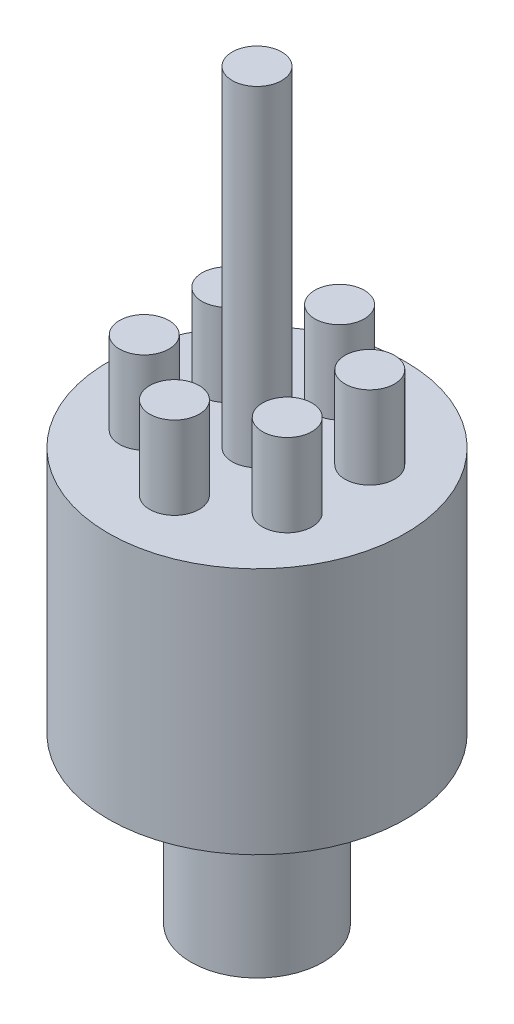
ISO-10303-21;
HEADER;
FILE_DESCRIPTION(('STEP AP214'),'2;1');
FILE_NAME('part.step','',(''),(''),'','','');
FILE_SCHEMA(('AUTOMOTIVE_DESIGN { 1 0 10303 214 1 1 1 1 }'));
ENDSEC;
DATA;
#1=APPLICATION_CONTEXT('core data for automotive mechanical design processes');
#2=APPLICATION_PROTOCOL_DEFINITION('international standard','automotive_design',2000,#1);
#3=PRODUCT_CONTEXT('',#1,'mechanical');
#4=PRODUCT('Part','Part','',(#3));
#5=PRODUCT_RELATED_PRODUCT_CATEGORY('part','',(#4));
#6=PRODUCT_DEFINITION_FORMATION('','',#4);
#7=PRODUCT_DEFINITION_CONTEXT('part definition',#1,'design');
#8=PRODUCT_DEFINITION('design','',#6,#7);
#9=PRODUCT_DEFINITION_SHAPE('','',#8);
#10=(LENGTH_UNIT() NAMED_UNIT(*) SI_UNIT(.MILLI.,.METRE.));
#11=(NAMED_UNIT(*) PLANE_ANGLE_UNIT() SI_UNIT($,.RADIAN.));
#12=(NAMED_UNIT(*) SI_UNIT($,.STERADIAN.) SOLID_ANGLE_UNIT());
#13=UNCERTAINTY_MEASURE_WITH_UNIT(LENGTH_MEASURE(1.E-05),#10,'distance_accuracy_value','');
#14=(GEOMETRIC_REPRESENTATION_CONTEXT(3) GLOBAL_UNCERTAINTY_ASSIGNED_CONTEXT((#13)) GLOBAL_UNIT_ASSIGNED_CONTEXT((#10,
#11,#12)) REPRESENTATION_CONTEXT('',''));
#15=CARTESIAN_POINT('',(0.,0.,0.));
#16=DIRECTION('',(0.,0.,1.));
#17=DIRECTION('',(1.,0.,0.));
#18=AXIS2_PLACEMENT_3D('',#15,#16,#17);
#19=CARTESIAN_POINT('',(0.,0.,0.));
#20=DIRECTION('',(0.,-1.,0.));
#21=DIRECTION('',(0.,0.,-1.));
#22=AXIS2_PLACEMENT_3D('',#19,#20,#21);
#23=PLANE('',#22);
#24=CARTESIAN_POINT('',(0.,0.,0.));
#25=DIRECTION('',(0.,1.,0.));
#26=DIRECTION('',(0.,0.,1.));
#27=AXIS2_PLACEMENT_3D('',#24,#25,#26);
#28=CIRCLE('',#27,7.99999999999999);
#29=CARTESIAN_POINT('',(0.,0.,7.99999999999999));
#30=VERTEX_POINT('',#29);
#31=EDGE_CURVE('E10',#30,#30,#28,.T.);
#32=ORIENTED_EDGE('',*,*,#31,.F.);
#33=EDGE_LOOP('',(#32));
#34=FACE_BOUND('',#33,.T.);
#35=ADVANCED_FACE('F37',(#34),#23,.T.);
#36=CARTESIAN_POINT('',(0.,90.,0.));
#37=DIRECTION('',(0.,1.,0.));
#38=DIRECTION('',(0.,0.,1.));
#39=AXIS2_PLACEMENT_3D('',#36,#37,#38);
#40=CYLINDRICAL_SURFACE('',#39,7.99999999999999);
#41=ORIENTED_EDGE('',*,*,#31,.T.);
#42=EDGE_LOOP('',(#41));
#43=FACE_BOUND('',#42,.T.);
#44=CARTESIAN_POINT('',(0.,20.,0.));
#45=DIRECTION('',(0.,1.,0.));
#46=DIRECTION('',(0.,0.,1.));
#47=AXIS2_PLACEMENT_3D('',#44,#45,#46);
#48=CIRCLE('',#47,7.99999999999999);
#49=CARTESIAN_POINT('',(0.,20.,7.99999999999999));
#50=VERTEX_POINT('',#49);
#51=EDGE_CURVE('E44',#50,#50,#48,.T.);
#52=ORIENTED_EDGE('',*,*,#51,.F.);
#53=EDGE_LOOP('',(#52));
#54=FACE_BOUND('',#53,.T.);
#55=ADVANCED_FACE('F162',(#43,#54),#40,.T.);
#56=CARTESIAN_POINT('',(0.,20.,7.99999999999999));
#57=DIRECTION('',(0.,-1.,0.));
#58=DIRECTION('',(0.,0.,-1.));
#59=AXIS2_PLACEMENT_3D('',#56,#57,#58);
#60=PLANE('',#59);
#61=ORIENTED_EDGE('',*,*,#51,.T.);
#62=EDGE_LOOP('',(#61));
#63=FACE_BOUND('',#62,.T.);
#64=CARTESIAN_POINT('',(0.,20.,0.));
#65=DIRECTION('',(0.,1.,0.));
#66=DIRECTION('',(0.,0.,1.));
#67=AXIS2_PLACEMENT_3D('',#64,#65,#66);
#68=CIRCLE('',#67,18.);
#69=CARTESIAN_POINT('',(0.,20.,18.));
#70=VERTEX_POINT('',#69);
#71=EDGE_CURVE('E49',#70,#70,#68,.T.);
#72=ORIENTED_EDGE('',*,*,#71,.F.);
#73=EDGE_LOOP('',(#72));
#74=FACE_BOUND('',#73,.T.);
#75=ADVANCED_FACE('F167',(#63,#74),#60,.T.);
#76=CARTESIAN_POINT('',(0.,90.,0.));
#77=DIRECTION('',(0.,1.,0.));
#78=DIRECTION('',(0.,0.,1.));
#79=AXIS2_PLACEMENT_3D('',#76,#77,#78);
#80=CYLINDRICAL_SURFACE('',#79,18.);
#81=ORIENTED_EDGE('',*,*,#71,.T.);
#82=EDGE_LOOP('',(#81));
#83=FACE_BOUND('',#82,.T.);
#84=CARTESIAN_POINT('',(0.,50.,0.));
#85=DIRECTION('',(0.,1.,0.));
#86=DIRECTION('',(0.,0.,1.));
#87=AXIS2_PLACEMENT_3D('',#84,#85,#86);
#88=CIRCLE('',#87,18.);
#89=CARTESIAN_POINT('',(0.,50.,18.));
#90=VERTEX_POINT('',#89);
#91=EDGE_CURVE('E54',#90,#90,#88,.T.);
#92=ORIENTED_EDGE('',*,*,#91,.F.);
#93=EDGE_LOOP('',(#92));
#94=FACE_BOUND('',#93,.T.);
#95=ADVANCED_FACE('F130',(#83,#94),#80,.T.);
#96=CARTESIAN_POINT('',(0.,50.,18.));
#97=DIRECTION('',(0.,1.,0.));
#98=DIRECTION('',(0.,0.,1.));
#99=AXIS2_PLACEMENT_3D('',#96,#97,#98);
#100=PLANE('',#99);
#101=CARTESIAN_POINT('',(8.66025403784433,50.,-5.0000000000001));
#102=DIRECTION('',(0.,1.,0.));
#103=DIRECTION('',(-0.866025403784433,0.,0.50000000000001));
#104=AXIS2_PLACEMENT_3D('',#101,#102,#103);
#105=CIRCLE('',#104,3.);
#106=CARTESIAN_POINT('',(6.06217782649103,50.,-3.50000000000007));
#107=VERTEX_POINT('',#106);
#108=EDGE_CURVE('E109',#107,#107,#105,.T.);
#109=ORIENTED_EDGE('',*,*,#108,.F.);
#110=EDGE_LOOP('',(#109));
#111=FACE_BOUND('',#110,.T.);
#112=CARTESIAN_POINT('',(8.66025403784443,50.,4.99999999999992));
#113=DIRECTION('',(0.,1.,0.));
#114=DIRECTION('',(-0.866025403784443,0.,-0.499999999999992));
#115=AXIS2_PLACEMENT_3D('',#112,#113,#114);
#116=CIRCLE('',#115,3.);
#117=CARTESIAN_POINT('',(6.0621778264911,50.,3.49999999999994));
#118=VERTEX_POINT('',#117);
#119=EDGE_CURVE('E101',#118,#118,#116,.T.);
#120=ORIENTED_EDGE('',*,*,#119,.F.);
#121=EDGE_LOOP('',(#120));
#122=FACE_BOUND('',#121,.T.);
#123=CARTESIAN_POINT('',(0.,50.,10.));
#124=DIRECTION('',(0.,1.,0.));
#125=DIRECTION('',(0.,0.,-1.));
#126=AXIS2_PLACEMENT_3D('',#123,#124,#125);
#127=CIRCLE('',#126,3.);
#128=CARTESIAN_POINT('',(0.,50.,7.));
#129=VERTEX_POINT('',#128);
#130=EDGE_CURVE('E93',#129,#129,#127,.T.);
#131=ORIENTED_EDGE('',*,*,#130,.F.);
#132=EDGE_LOOP('',(#131));
#133=FACE_BOUND('',#132,.T.);
#134=CARTESIAN_POINT('',(-8.66025403784437,50.,5.00000000000004));
#135=DIRECTION('',(0.,1.,0.));
#136=DIRECTION('',(0.866025403784436,0.,-0.500000000000004));
#137=AXIS2_PLACEMENT_3D('',#134,#135,#136);
#138=CIRCLE('',#137,3.);
#139=CARTESIAN_POINT('',(-6.06217782649106,50.,3.50000000000003));
#140=VERTEX_POINT('',#139);
#141=EDGE_CURVE('E85',#140,#140,#138,.T.);
#142=ORIENTED_EDGE('',*,*,#141,.F.);
#143=EDGE_LOOP('',(#142));
#144=FACE_BOUND('',#143,.T.);
#145=CARTESIAN_POINT('',(-8.6602540378444,50.,-4.99999999999998));
#146=DIRECTION('',(0.,1.,0.));
#147=DIRECTION('',(0.86602540378444,0.,0.499999999999998));
#148=AXIS2_PLACEMENT_3D('',#145,#146,#147);
#149=CIRCLE('',#148,3.);
#150=CARTESIAN_POINT('',(-6.06217782649108,50.,-3.49999999999999));
#151=VERTEX_POINT('',#150);
#152=EDGE_CURVE('E77',#151,#151,#149,.T.);
#153=ORIENTED_EDGE('',*,*,#152,.F.);
#154=EDGE_LOOP('',(#153));
#155=FACE_BOUND('',#154,.T.);
#156=CARTESIAN_POINT('',(0.,50.,-10.));
#157=DIRECTION('',(0.,1.,0.));
#158=DIRECTION('',(0.,0.,1.));
#159=AXIS2_PLACEMENT_3D('',#156,#157,#158);
#160=CIRCLE('',#159,3.);
#161=CARTESIAN_POINT('',(0.,50.,-7.));
#162=VERTEX_POINT('',#161);
#163=EDGE_CURVE('E69',#162,#162,#160,.T.);
#164=ORIENTED_EDGE('',*,*,#163,.F.);
#165=EDGE_LOOP('',(#164));
#166=FACE_BOUND('',#165,.T.);
#167=ORIENTED_EDGE('',*,*,#91,.T.);
#168=EDGE_LOOP('',(#167));
#169=FACE_BOUND('',#168,.T.);
#170=CARTESIAN_POINT('',(0.,50.,0.));
#171=DIRECTION('',(0.,1.,0.));
#172=DIRECTION('',(0.,0.,1.));
#173=AXIS2_PLACEMENT_3D('',#170,#171,#172);
#174=CIRCLE('',#173,3.);
#175=CARTESIAN_POINT('',(0.,50.,3.));
#176=VERTEX_POINT('',#175);
#177=EDGE_CURVE('E60',#176,#176,#174,.T.);
#178=ORIENTED_EDGE('',*,*,#177,.F.);
#179=EDGE_LOOP('',(#178));
#180=FACE_BOUND('',#179,.T.);
#181=ADVANCED_FACE('F126',(#111,#122,#133,#144,#155,#166,#169,#180),#100,.T.);
#182=CARTESIAN_POINT('',(0.,90.,0.));
#183=DIRECTION('',(0.,1.,0.));
#184=DIRECTION('',(0.,0.,1.));
#185=AXIS2_PLACEMENT_3D('',#182,#183,#184);
#186=CYLINDRICAL_SURFACE('',#185,3.);
#187=ORIENTED_EDGE('',*,*,#177,.T.);
#188=EDGE_LOOP('',(#187));
#189=FACE_BOUND('',#188,.T.);
#190=CARTESIAN_POINT('',(0.,90.,0.));
#191=DIRECTION('',(0.,1.,0.));
#192=DIRECTION('',(0.,0.,1.));
#193=AXIS2_PLACEMENT_3D('',#190,#191,#192);
#194=CIRCLE('',#193,3.);
#195=CARTESIAN_POINT('',(0.,90.,3.));
#196=VERTEX_POINT('',#195);
#197=EDGE_CURVE('E64',#196,#196,#194,.T.);
#198=ORIENTED_EDGE('',*,*,#197,.F.);
#199=EDGE_LOOP('',(#198));
#200=FACE_BOUND('',#199,.T.);
#201=ADVANCED_FACE('F129',(#189,#200),#186,.T.);
#202=CARTESIAN_POINT('',(0.,90.,3.));
#203=DIRECTION('',(0.,1.,0.));
#204=DIRECTION('',(0.,0.,1.));
#205=AXIS2_PLACEMENT_3D('',#202,#203,#204);
#206=PLANE('',#205);
#207=ORIENTED_EDGE('',*,*,#197,.T.);
#208=EDGE_LOOP('',(#207));
#209=FACE_BOUND('',#208,.T.);
#210=ADVANCED_FACE('F148',(#209),#206,.T.);
#211=CARTESIAN_POINT('',(0.,60.,-10.));
#212=DIRECTION('',(0.,-1.,0.));
#213=DIRECTION('',(0.,0.,-1.));
#214=AXIS2_PLACEMENT_3D('',#211,#212,#213);
#215=CYLINDRICAL_SURFACE('',#214,3.);
#216=CARTESIAN_POINT('',(0.,60.,-10.));
#217=DIRECTION('',(0.,1.,0.));
#218=DIRECTION('',(0.,0.,1.));
#219=AXIS2_PLACEMENT_3D('',#216,#217,#218);
#220=CIRCLE('',#219,3.);
#221=CARTESIAN_POINT('',(0.,60.,-7.));
#222=VERTEX_POINT('',#221);
#223=EDGE_CURVE('E68',#222,#222,#220,.T.);
#224=ORIENTED_EDGE('',*,*,#223,.F.);
#225=EDGE_LOOP('',(#224));
#226=FACE_BOUND('',#225,.T.);
#227=ORIENTED_EDGE('',*,*,#163,.T.);
#228=EDGE_LOOP('',(#227));
#229=FACE_BOUND('',#228,.T.);
#230=ADVANCED_FACE('F153',(#226,#229),#215,.T.);
#231=CARTESIAN_POINT('',(0.,60.,-10.));
#232=DIRECTION('',(0.,1.,0.));
#233=DIRECTION('',(0.,0.,1.));
#234=AXIS2_PLACEMENT_3D('',#231,#232,#233);
#235=PLANE('',#234);
#236=ORIENTED_EDGE('',*,*,#223,.T.);
#237=EDGE_LOOP('',(#236));
#238=FACE_BOUND('',#237,.T.);
#239=ADVANCED_FACE('F158',(#238),#235,.T.);
#240=CARTESIAN_POINT('',(-8.6602540378444,60.,-4.99999999999998));
#241=DIRECTION('',(0.,-1.,0.));
#242=DIRECTION('',(0.,0.,-1.));
#243=AXIS2_PLACEMENT_3D('',#240,#241,#242);
#244=CYLINDRICAL_SURFACE('',#243,3.);
#245=CARTESIAN_POINT('',(-8.6602540378444,60.,-4.99999999999998));
#246=DIRECTION('',(0.,1.,0.));
#247=DIRECTION('',(0.86602540378444,0.,0.499999999999998));
#248=AXIS2_PLACEMENT_3D('',#245,#246,#247);
#249=CIRCLE('',#248,3.);
#250=CARTESIAN_POINT('',(-6.06217782649108,60.,-3.49999999999999));
#251=VERTEX_POINT('',#250);
#252=EDGE_CURVE('E73',#251,#251,#249,.T.);
#253=ORIENTED_EDGE('',*,*,#252,.F.);
#254=EDGE_LOOP('',(#253));
#255=FACE_BOUND('',#254,.T.);
#256=ORIENTED_EDGE('',*,*,#152,.T.);
#257=EDGE_LOOP('',(#256));
#258=FACE_BOUND('',#257,.T.);
#259=ADVANCED_FACE('F210',(#255,#258),#244,.T.);
#260=CARTESIAN_POINT('',(-8.6602540378444,60.,-4.99999999999998));
#261=DIRECTION('',(0.,1.,0.));
#262=DIRECTION('',(0.86602540378444,0.,0.499999999999998));
#263=AXIS2_PLACEMENT_3D('',#260,#261,#262);
#264=PLANE('',#263);
#265=ORIENTED_EDGE('',*,*,#252,.T.);
#266=EDGE_LOOP('',(#265));
#267=FACE_BOUND('',#266,.T.);
#268=ADVANCED_FACE('F220',(#267),#264,.T.);
#269=CARTESIAN_POINT('',(-8.66025403784437,60.,5.00000000000004));
#270=DIRECTION('',(0.,-1.,0.));
#271=DIRECTION('',(0.,0.,-1.));
#272=AXIS2_PLACEMENT_3D('',#269,#270,#271);
#273=CYLINDRICAL_SURFACE('',#272,3.);
#274=CARTESIAN_POINT('',(-8.66025403784437,60.,5.00000000000004));
#275=DIRECTION('',(0.,1.,0.));
#276=DIRECTION('',(0.866025403784436,0.,-0.500000000000004));
#277=AXIS2_PLACEMENT_3D('',#274,#275,#276);
#278=CIRCLE('',#277,3.);
#279=CARTESIAN_POINT('',(-6.06217782649106,60.,3.50000000000003));
#280=VERTEX_POINT('',#279);
#281=EDGE_CURVE('E81',#280,#280,#278,.T.);
#282=ORIENTED_EDGE('',*,*,#281,.F.);
#283=EDGE_LOOP('',(#282));
#284=FACE_BOUND('',#283,.T.);
#285=ORIENTED_EDGE('',*,*,#141,.T.);
#286=EDGE_LOOP('',(#285));
#287=FACE_BOUND('',#286,.T.);
#288=ADVANCED_FACE('F227',(#284,#287),#273,.T.);
#289=CARTESIAN_POINT('',(-8.66025403784437,60.,5.00000000000004));
#290=DIRECTION('',(0.,1.,0.));
#291=DIRECTION('',(0.866025403784436,0.,-0.500000000000004));
#292=AXIS2_PLACEMENT_3D('',#289,#290,#291);
#293=PLANE('',#292);
#294=ORIENTED_EDGE('',*,*,#281,.T.);
#295=EDGE_LOOP('',(#294));
#296=FACE_BOUND('',#295,.T.);
#297=ADVANCED_FACE('F235',(#296),#293,.T.);
#298=CARTESIAN_POINT('',(0.,60.,10.));
#299=DIRECTION('',(0.,-1.,0.));
#300=DIRECTION('',(0.,0.,-1.));
#301=AXIS2_PLACEMENT_3D('',#298,#299,#300);
#302=CYLINDRICAL_SURFACE('',#301,3.);
#303=CARTESIAN_POINT('',(0.,60.,10.));
#304=DIRECTION('',(0.,1.,0.));
#305=DIRECTION('',(0.,0.,-1.));
#306=AXIS2_PLACEMENT_3D('',#303,#304,#305);
#307=CIRCLE('',#306,3.);
#308=CARTESIAN_POINT('',(0.,60.,7.));
#309=VERTEX_POINT('',#308);
#310=EDGE_CURVE('E89',#309,#309,#307,.T.);
#311=ORIENTED_EDGE('',*,*,#310,.F.);
#312=EDGE_LOOP('',(#311));
#313=FACE_BOUND('',#312,.T.);
#314=ORIENTED_EDGE('',*,*,#130,.T.);
#315=EDGE_LOOP('',(#314));
#316=FACE_BOUND('',#315,.T.);
#317=ADVANCED_FACE('F243',(#313,#316),#302,.T.);
#318=CARTESIAN_POINT('',(0.,60.,10.));
#319=DIRECTION('',(0.,1.,0.));
#320=DIRECTION('',(0.,0.,-1.));
#321=AXIS2_PLACEMENT_3D('',#318,#319,#320);
#322=PLANE('',#321);
#323=ORIENTED_EDGE('',*,*,#310,.T.);
#324=EDGE_LOOP('',(#323));
#325=FACE_BOUND('',#324,.T.);
#326=ADVANCED_FACE('F251',(#325),#322,.T.);
#327=CARTESIAN_POINT('',(8.66025403784443,60.,4.99999999999992));
#328=DIRECTION('',(0.,-1.,0.));
#329=DIRECTION('',(0.,0.,-1.));
#330=AXIS2_PLACEMENT_3D('',#327,#328,#329);
#331=CYLINDRICAL_SURFACE('',#330,3.);
#332=CARTESIAN_POINT('',(8.66025403784443,60.,4.99999999999992));
#333=DIRECTION('',(0.,1.,0.));
#334=DIRECTION('',(-0.866025403784443,0.,-0.499999999999992));
#335=AXIS2_PLACEMENT_3D('',#332,#333,#334);
#336=CIRCLE('',#335,3.);
#337=CARTESIAN_POINT('',(6.0621778264911,60.,3.49999999999994));
#338=VERTEX_POINT('',#337);
#339=EDGE_CURVE('E97',#338,#338,#336,.T.);
#340=ORIENTED_EDGE('',*,*,#339,.F.);
#341=EDGE_LOOP('',(#340));
#342=FACE_BOUND('',#341,.T.);
#343=ORIENTED_EDGE('',*,*,#119,.T.);
#344=EDGE_LOOP('',(#343));
#345=FACE_BOUND('',#344,.T.);
#346=ADVANCED_FACE('F259',(#342,#345),#331,.T.);
#347=CARTESIAN_POINT('',(8.66025403784443,60.,4.99999999999992));
#348=DIRECTION('',(0.,1.,0.));
#349=DIRECTION('',(-0.866025403784443,0.,-0.499999999999992));
#350=AXIS2_PLACEMENT_3D('',#347,#348,#349);
#351=PLANE('',#350);
#352=ORIENTED_EDGE('',*,*,#339,.T.);
#353=EDGE_LOOP('',(#352));
#354=FACE_BOUND('',#353,.T.);
#355=ADVANCED_FACE('F122',(#354),#351,.T.);
#356=CARTESIAN_POINT('',(8.66025403784433,60.,-5.0000000000001));
#357=DIRECTION('',(0.,-1.,0.));
#358=DIRECTION('',(0.,0.,-1.));
#359=AXIS2_PLACEMENT_3D('',#356,#357,#358);
#360=CYLINDRICAL_SURFACE('',#359,3.);
#361=CARTESIAN_POINT('',(8.66025403784433,60.,-5.0000000000001));
#362=DIRECTION('',(0.,1.,0.));
#363=DIRECTION('',(-0.866025403784433,0.,0.50000000000001));
#364=AXIS2_PLACEMENT_3D('',#361,#362,#363);
#365=CIRCLE('',#364,3.);
#366=CARTESIAN_POINT('',(6.06217782649103,60.,-3.50000000000007));
#367=VERTEX_POINT('',#366);
#368=EDGE_CURVE('E105',#367,#367,#365,.T.);
#369=ORIENTED_EDGE('',*,*,#368,.F.);
#370=EDGE_LOOP('',(#369));
#371=FACE_BOUND('',#370,.T.);
#372=ORIENTED_EDGE('',*,*,#108,.T.);
#373=EDGE_LOOP('',(#372));
#374=FACE_BOUND('',#373,.T.);
#375=ADVANCED_FACE('F119',(#371,#374),#360,.T.);
#376=CARTESIAN_POINT('',(8.66025403784433,60.,-5.0000000000001));
#377=DIRECTION('',(0.,1.,0.));
#378=DIRECTION('',(-0.866025403784433,0.,0.50000000000001));
#379=AXIS2_PLACEMENT_3D('',#376,#377,#378);
#380=PLANE('',#379);
#381=ORIENTED_EDGE('',*,*,#368,.T.);
#382=EDGE_LOOP('',(#381));
#383=FACE_BOUND('',#382,.T.);
#384=ADVANCED_FACE('F117',(#383),#380,.T.);
#385=CLOSED_SHELL('',(#35,#55,#75,#95,#181,#201,#210,#230,#239,#259,#268,#288,#297,#317,#326,
#346,#355,#375,#384));
#386=MANIFOLD_SOLID_BREP('B2',#385);
#387=ADVANCED_BREP_SHAPE_REPRESENTATION('',(#18,#386),#14);
#388=SHAPE_DEFINITION_REPRESENTATION(#9,#387);
ENDSEC;
END-ISO-10303-21;
